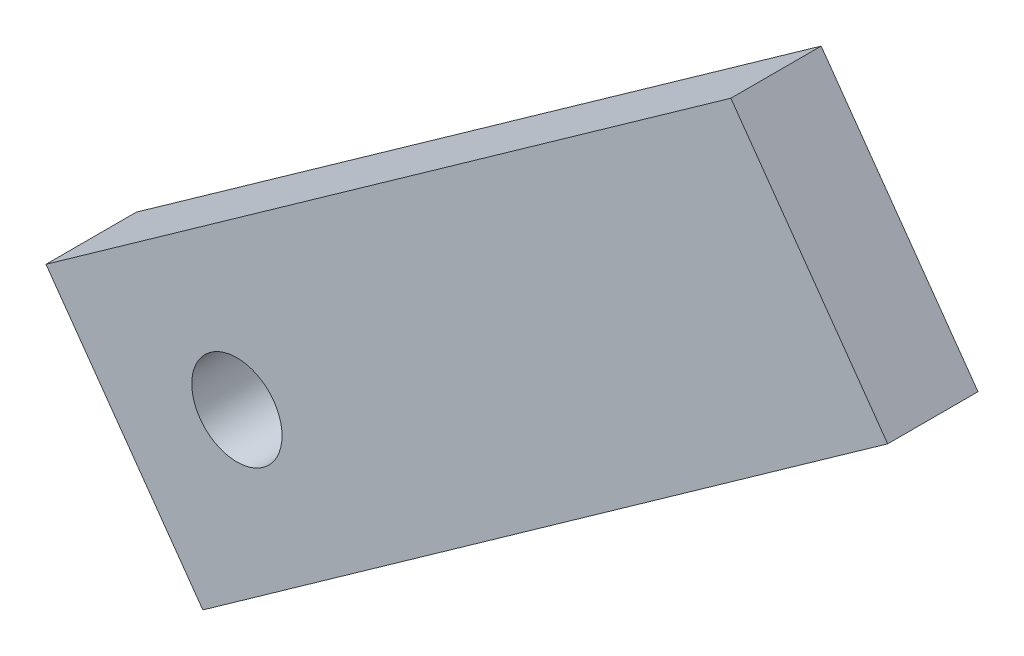
ISO-10303-21;
HEADER;
FILE_DESCRIPTION(('STEP AP214'),'2;1');
FILE_NAME('part.step','',(''),(''),'','','');
FILE_SCHEMA(('AUTOMOTIVE_DESIGN { 1 0 10303 214 1 1 1 1 }'));
ENDSEC;
DATA;
#1=APPLICATION_CONTEXT('core data for automotive mechanical design processes');
#2=APPLICATION_PROTOCOL_DEFINITION('international standard','automotive_design',2000,#1);
#3=PRODUCT_CONTEXT('',#1,'mechanical');
#4=PRODUCT('Part','Part','',(#3));
#5=PRODUCT_RELATED_PRODUCT_CATEGORY('part','',(#4));
#6=PRODUCT_DEFINITION_FORMATION('','',#4);
#7=PRODUCT_DEFINITION_CONTEXT('part definition',#1,'design');
#8=PRODUCT_DEFINITION('design','',#6,#7);
#9=PRODUCT_DEFINITION_SHAPE('','',#8);
#10=(LENGTH_UNIT() NAMED_UNIT(*) SI_UNIT(.MILLI.,.METRE.));
#11=(NAMED_UNIT(*) PLANE_ANGLE_UNIT() SI_UNIT($,.RADIAN.));
#12=(NAMED_UNIT(*) SI_UNIT($,.STERADIAN.) SOLID_ANGLE_UNIT());
#13=UNCERTAINTY_MEASURE_WITH_UNIT(LENGTH_MEASURE(1.E-05),#10,'distance_accuracy_value','');
#14=(GEOMETRIC_REPRESENTATION_CONTEXT(3) GLOBAL_UNCERTAINTY_ASSIGNED_CONTEXT((#13)) GLOBAL_UNIT_ASSIGNED_CONTEXT((#10,
#11,#12)) REPRESENTATION_CONTEXT('',''));
#15=CARTESIAN_POINT('',(0.,0.,0.));
#16=DIRECTION('',(0.,0.,1.));
#17=DIRECTION('',(1.,0.,0.));
#18=AXIS2_PLACEMENT_3D('',#15,#16,#17);
#19=CARTESIAN_POINT('',(-41.0913514913306,-29.1748595588448,2.54));
#20=DIRECTION('',(0.815382984620277,0.578921919080397,0.));
#21=DIRECTION('',(-0.578921919080397,0.815382984620277,0.));
#22=AXIS2_PLACEMENT_3D('',#19,#20,#21);
#23=PLANE('',#22);
#24=DIRECTION('',(0.578921919080397,-0.815382984620277,0.));
#25=VECTOR('',#24,1.);
#26=CARTESIAN_POINT('',(-41.0913514913306,-29.1748595588448,0.));
#27=LINE('',#26,#25);
#28=CARTESIAN_POINT('',(-67.8066681913469,8.45234706089641,0.));
#29=VERTEX_POINT('',#28);
#30=CARTESIAN_POINT('',(-63.3952831679543,2.2391287180899,0.));
#31=VERTEX_POINT('',#30);
#32=EDGE_CURVE('E101',#29,#31,#27,.T.);
#33=ORIENTED_EDGE('',*,*,#32,.T.);
#34=DIRECTION('',(0.,0.,-1.));
#35=VECTOR('',#34,1.);
#36=CARTESIAN_POINT('',(-63.3952831679543,2.2391287180899,2.54));
#37=LINE('',#36,#35);
#38=CARTESIAN_POINT('',(-63.3952831679543,2.2391287180899,2.54));
#39=VERTEX_POINT('',#38);
#40=EDGE_CURVE('E11',#39,#31,#37,.T.);
#41=ORIENTED_EDGE('',*,*,#40,.F.);
#42=DIRECTION('',(0.578921919080397,-0.815382984620277,0.));
#43=VECTOR('',#42,1.);
#44=CARTESIAN_POINT('',(-41.0913514913306,-29.1748595588448,2.54));
#45=LINE('',#44,#43);
#46=CARTESIAN_POINT('',(-67.8066681913469,8.45234706089641,2.54));
#47=VERTEX_POINT('',#46);
#48=EDGE_CURVE('E84',#47,#39,#45,.T.);
#49=ORIENTED_EDGE('',*,*,#48,.F.);
#50=DIRECTION('',(0.,0.,-1.));
#51=VECTOR('',#50,1.);
#52=CARTESIAN_POINT('',(-67.8066681913469,8.45234706089641,2.54));
#53=LINE('',#52,#51);
#54=EDGE_CURVE('E50',#47,#29,#53,.T.);
#55=ORIENTED_EDGE('',*,*,#54,.T.);
#56=EDGE_LOOP('',(#33,#41,#49,#55));
#57=FACE_BOUND('',#56,.T.);
#58=ADVANCED_FACE('F34',(#57),#23,.F.);
#59=CARTESIAN_POINT('',(-22.3039316766238,31.4139882769347,2.54));
#60=DIRECTION('',(-0.578921919080398,0.815382984620276,0.));
#61=DIRECTION('',(-0.815382984620276,-0.578921919080398,0.));
#62=AXIS2_PLACEMENT_3D('',#59,#60,#61);
#63=PLANE('',#62);
#64=DIRECTION('',(0.815382984620276,0.578921919080398,0.));
#65=VECTOR('',#64,1.);
#66=CARTESIAN_POINT('',(-22.3039316766238,31.4139882769347,0.));
#67=LINE('',#66,#65);
#68=CARTESIAN_POINT('',(-44.1343063052541,15.9144222906071,0.));
#69=VERTEX_POINT('',#68);
#70=EDGE_CURVE('E89',#31,#69,#67,.T.);
#71=ORIENTED_EDGE('',*,*,#70,.T.);
#72=DIRECTION('',(0.,0.,-1.));
#73=VECTOR('',#72,1.);
#74=CARTESIAN_POINT('',(-44.1343063052541,15.9144222906071,2.54));
#75=LINE('',#74,#73);
#76=CARTESIAN_POINT('',(-44.1343063052541,15.9144222906071,2.54));
#77=VERTEX_POINT('',#76);
#78=EDGE_CURVE('E42',#77,#69,#75,.T.);
#79=ORIENTED_EDGE('',*,*,#78,.F.);
#80=DIRECTION('',(0.815382984620276,0.578921919080398,0.));
#81=VECTOR('',#80,1.);
#82=CARTESIAN_POINT('',(-22.3039316766238,31.4139882769347,2.54));
#83=LINE('',#82,#81);
#84=EDGE_CURVE('E76',#39,#77,#83,.T.);
#85=ORIENTED_EDGE('',*,*,#84,.F.);
#86=ORIENTED_EDGE('',*,*,#40,.T.);
#87=EDGE_LOOP('',(#71,#79,#85,#86));
#88=FACE_BOUND('',#87,.T.);
#89=ADVANCED_FACE('F88',(#88),#63,.F.);
#90=CARTESIAN_POINT('',(-21.8303746286304,-15.4995659863276,2.54));
#91=DIRECTION('',(-0.815382984620276,-0.578921919080397,0.));
#92=DIRECTION('',(0.578921919080397,-0.815382984620277,0.));
#93=AXIS2_PLACEMENT_3D('',#90,#91,#92);
#94=PLANE('',#93);
#95=DIRECTION('',(-0.578921919080397,0.815382984620276,0.));
#96=VECTOR('',#95,1.);
#97=CARTESIAN_POINT('',(-21.8303746286304,-15.4995659863276,0.));
#98=LINE('',#97,#96);
#99=CARTESIAN_POINT('',(-48.5456913286467,22.1276406334136,0.));
#100=VERTEX_POINT('',#99);
#101=EDGE_CURVE('E104',#69,#100,#98,.T.);
#102=ORIENTED_EDGE('',*,*,#101,.T.);
#103=DIRECTION('',(0.,0.,-1.));
#104=VECTOR('',#103,1.);
#105=CARTESIAN_POINT('',(-48.5456913286467,22.1276406334136,2.54));
#106=LINE('',#105,#104);
#107=CARTESIAN_POINT('',(-48.5456913286467,22.1276406334136,2.54));
#108=VERTEX_POINT('',#107);
#109=EDGE_CURVE('E65',#108,#100,#106,.T.);
#110=ORIENTED_EDGE('',*,*,#109,.F.);
#111=DIRECTION('',(-0.578921919080397,0.815382984620276,0.));
#112=VECTOR('',#111,1.);
#113=CARTESIAN_POINT('',(-21.8303746286304,-15.4995659863276,2.54));
#114=LINE('',#113,#112);
#115=EDGE_CURVE('E83',#77,#108,#114,.T.);
#116=ORIENTED_EDGE('',*,*,#115,.F.);
#117=ORIENTED_EDGE('',*,*,#78,.T.);
#118=EDGE_LOOP('',(#102,#110,#116,#117));
#119=FACE_BOUND('',#118,.T.);
#120=ADVANCED_FACE('F92',(#119),#94,.F.);
#121=CARTESIAN_POINT('',(-26.7153167000163,37.6272066197412,2.54));
#122=DIRECTION('',(-0.578921919080397,0.815382984620277,0.));
#123=DIRECTION('',(-0.815382984620277,-0.578921919080397,0.));
#124=AXIS2_PLACEMENT_3D('',#121,#122,#123);
#125=PLANE('',#124);
#126=DIRECTION('',(0.815382984620277,0.578921919080397,0.));
#127=VECTOR('',#126,1.);
#128=CARTESIAN_POINT('',(-26.7153167000163,37.6272066197412,0.));
#129=LINE('',#128,#127);
#130=EDGE_CURVE('E106',#29,#100,#129,.T.);
#131=ORIENTED_EDGE('',*,*,#130,.F.);
#132=ORIENTED_EDGE('',*,*,#54,.F.);
#133=DIRECTION('',(0.815382984620277,0.578921919080397,0.));
#134=VECTOR('',#133,1.);
#135=CARTESIAN_POINT('',(-26.7153167000163,37.6272066197412,2.54));
#136=LINE('',#135,#134);
#137=EDGE_CURVE('E93',#47,#108,#136,.T.);
#138=ORIENTED_EDGE('',*,*,#137,.T.);
#139=ORIENTED_EDGE('',*,*,#109,.T.);
#140=EDGE_LOOP('',(#131,#132,#138,#139));
#141=FACE_BOUND('',#140,.T.);
#142=ADVANCED_FACE('F119',(#141),#125,.T.);
#143=CARTESIAN_POINT('',(-62.4374324616641,7.59185357426359,2.54));
#144=DIRECTION('',(0.,0.,-1.));
#145=DIRECTION('',(-1.,0.,0.));
#146=AXIS2_PLACEMENT_3D('',#143,#144,#145);
#147=CYLINDRICAL_SURFACE('',#146,1.27);
#148=CARTESIAN_POINT('',(-62.4374324616641,7.59185357426359,2.54));
#149=DIRECTION('',(0.,0.,1.));
#150=DIRECTION('',(1.,0.,0.));
#151=AXIS2_PLACEMENT_3D('',#148,#149,#150);
#152=CIRCLE('',#151,1.27);
#153=CARTESIAN_POINT('',(-61.1674324616641,7.59185357426359,2.54));
#154=VERTEX_POINT('',#153);
#155=EDGE_CURVE('E95',#154,#154,#152,.T.);
#156=ORIENTED_EDGE('',*,*,#155,.T.);
#157=EDGE_LOOP('',(#156));
#158=FACE_BOUND('',#157,.T.);
#159=CARTESIAN_POINT('',(-62.4374324616641,7.59185357426359,0.));
#160=DIRECTION('',(0.,0.,1.));
#161=DIRECTION('',(1.,0.,0.));
#162=AXIS2_PLACEMENT_3D('',#159,#160,#161);
#163=CIRCLE('',#162,1.27);
#164=CARTESIAN_POINT('',(-61.1674324616641,7.59185357426359,0.));
#165=VERTEX_POINT('',#164);
#166=EDGE_CURVE('E109',#165,#165,#163,.T.);
#167=ORIENTED_EDGE('',*,*,#166,.F.);
#168=EDGE_LOOP('',(#167));
#169=FACE_BOUND('',#168,.T.);
#170=ADVANCED_FACE('F117',(#158,#169),#147,.F.);
#171=CARTESIAN_POINT('',(0.,0.,2.54));
#172=DIRECTION('',(0.,0.,1.));
#173=DIRECTION('',(1.,0.,0.));
#174=AXIS2_PLACEMENT_3D('',#171,#172,#173);
#175=PLANE('',#174);
#176=ORIENTED_EDGE('',*,*,#48,.T.);
#177=ORIENTED_EDGE('',*,*,#84,.T.);
#178=ORIENTED_EDGE('',*,*,#115,.T.);
#179=ORIENTED_EDGE('',*,*,#137,.F.);
#180=EDGE_LOOP('',(#176,#177,#178,#179));
#181=FACE_BOUND('',#180,.T.);
#182=ORIENTED_EDGE('',*,*,#155,.F.);
#183=EDGE_LOOP('',(#182));
#184=FACE_BOUND('',#183,.T.);
#185=ADVANCED_FACE('F79',(#181,#184),#175,.T.);
#186=CARTESIAN_POINT('',(0.,0.,0.));
#187=DIRECTION('',(0.,0.,1.));
#188=DIRECTION('',(1.,0.,0.));
#189=AXIS2_PLACEMENT_3D('',#186,#187,#188);
#190=PLANE('',#189);
#191=ORIENTED_EDGE('',*,*,#32,.F.);
#192=ORIENTED_EDGE('',*,*,#130,.T.);
#193=ORIENTED_EDGE('',*,*,#101,.F.);
#194=ORIENTED_EDGE('',*,*,#70,.F.);
#195=EDGE_LOOP('',(#191,#192,#193,#194));
#196=FACE_BOUND('',#195,.T.);
#197=ORIENTED_EDGE('',*,*,#166,.T.);
#198=EDGE_LOOP('',(#197));
#199=FACE_BOUND('',#198,.T.);
#200=ADVANCED_FACE('F115',(#196,#199),#190,.F.);
#201=CLOSED_SHELL('',(#58,#89,#120,#142,#170,#185,#200));
#202=MANIFOLD_SOLID_BREP('B2',#201);
#203=ADVANCED_BREP_SHAPE_REPRESENTATION('',(#18,#202),#14);
#204=SHAPE_DEFINITION_REPRESENTATION(#9,#203);
ENDSEC;
END-ISO-10303-21;
